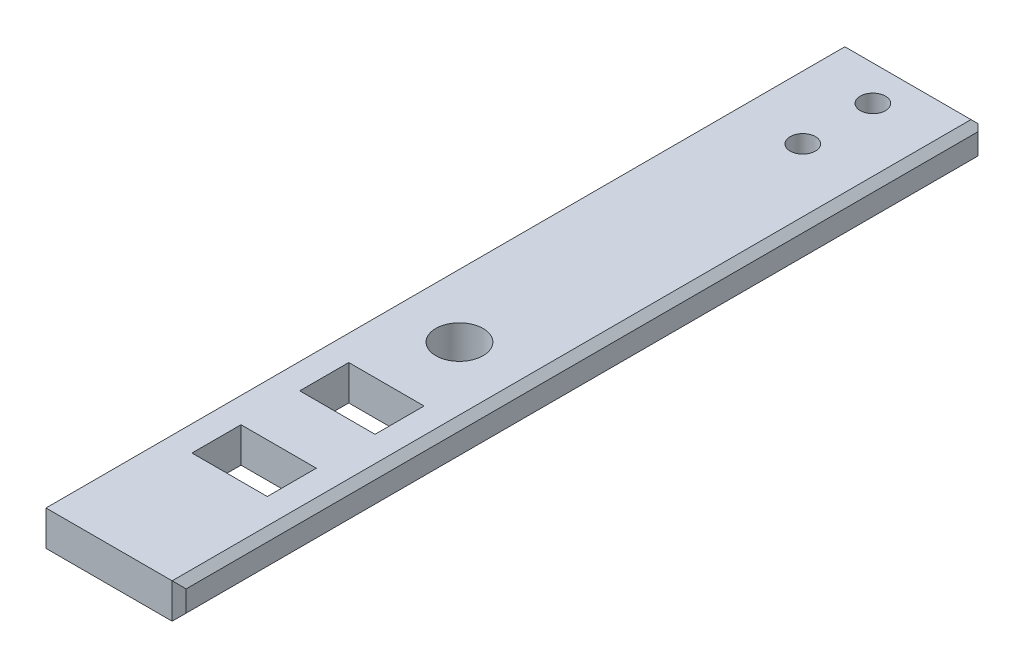
ISO-10303-21;
HEADER;
FILE_DESCRIPTION(('STEP AP214'),'2;1');
FILE_NAME('part.step','',(''),(''),'','','');
FILE_SCHEMA(('AUTOMOTIVE_DESIGN { 1 0 10303 214 1 1 1 1 }'));
ENDSEC;
DATA;
#1=APPLICATION_CONTEXT('core data for automotive mechanical design processes');
#2=APPLICATION_PROTOCOL_DEFINITION('international standard','automotive_design',2000,#1);
#3=PRODUCT_CONTEXT('',#1,'mechanical');
#4=PRODUCT('Part','Part','',(#3));
#5=PRODUCT_RELATED_PRODUCT_CATEGORY('part','',(#4));
#6=PRODUCT_DEFINITION_FORMATION('','',#4);
#7=PRODUCT_DEFINITION_CONTEXT('part definition',#1,'design');
#8=PRODUCT_DEFINITION('design','',#6,#7);
#9=PRODUCT_DEFINITION_SHAPE('','',#8);
#10=(LENGTH_UNIT() NAMED_UNIT(*) SI_UNIT(.MILLI.,.METRE.));
#11=(NAMED_UNIT(*) PLANE_ANGLE_UNIT() SI_UNIT($,.RADIAN.));
#12=(NAMED_UNIT(*) SI_UNIT($,.STERADIAN.) SOLID_ANGLE_UNIT());
#13=UNCERTAINTY_MEASURE_WITH_UNIT(LENGTH_MEASURE(1.E-05),#10,'distance_accuracy_value','');
#14=(GEOMETRIC_REPRESENTATION_CONTEXT(3) GLOBAL_UNCERTAINTY_ASSIGNED_CONTEXT((#13)) GLOBAL_UNIT_ASSIGNED_CONTEXT((#10,
#11,#12)) REPRESENTATION_CONTEXT('',''));
#15=CARTESIAN_POINT('',(0.,0.,0.));
#16=DIRECTION('',(0.,0.,1.));
#17=DIRECTION('',(1.,0.,0.));
#18=AXIS2_PLACEMENT_3D('',#15,#16,#17);
#19=CARTESIAN_POINT('',(0.,5.,0.));
#20=DIRECTION('',(0.,-1.,0.));
#21=DIRECTION('',(0.,0.,-1.));
#22=AXIS2_PLACEMENT_3D('',#19,#20,#21);
#23=PLANE('',#22);
#24=CARTESIAN_POINT('',(10.,5.,-50.));
#25=DIRECTION('',(0.,1.,0.));
#26=DIRECTION('',(0.,0.,1.));
#27=AXIS2_PLACEMENT_3D('',#24,#25,#26);
#28=CIRCLE('',#27,3.375);
#29=CARTESIAN_POINT('',(10.,5.,-46.625));
#30=VERTEX_POINT('',#29);
#31=EDGE_CURVE('E792',#30,#30,#28,.T.);
#32=ORIENTED_EDGE('',*,*,#31,.F.);
#33=EDGE_LOOP('',(#32));
#34=FACE_BOUND('',#33,.T.);
#35=DIRECTION('',(1.,0.,0.));
#36=VECTOR('',#35,1.);
#37=CARTESIAN_POINT('',(15.3749999999999,5.,-39.5793225891778));
#38=LINE('',#37,#36);
#39=CARTESIAN_POINT('',(4.62499999999994,5.,-39.5793225891778));
#40=VERTEX_POINT('',#39);
#41=CARTESIAN_POINT('',(15.3749999999999,5.,-39.5793225891778));
#42=VERTEX_POINT('',#41);
#43=EDGE_CURVE('E197',#40,#42,#38,.T.);
#44=ORIENTED_EDGE('',*,*,#43,.T.);
#45=DIRECTION('',(0.,0.,1.));
#46=VECTOR('',#45,1.);
#47=CARTESIAN_POINT('',(15.3749999999999,5.,-39.5793225891778));
#48=LINE('',#47,#46);
#49=CARTESIAN_POINT('',(15.3749999999999,5.,-32.5793225891778));
#50=VERTEX_POINT('',#49);
#51=EDGE_CURVE('E205',#42,#50,#48,.T.);
#52=ORIENTED_EDGE('',*,*,#51,.T.);
#53=DIRECTION('',(-1.,0.,0.));
#54=VECTOR('',#53,1.);
#55=CARTESIAN_POINT('',(15.3749999999999,5.,-32.5793225891778));
#56=LINE('',#55,#54);
#57=CARTESIAN_POINT('',(4.62499999999994,5.,-32.5793225891778));
#58=VERTEX_POINT('',#57);
#59=EDGE_CURVE('E219',#50,#58,#56,.T.);
#60=ORIENTED_EDGE('',*,*,#59,.T.);
#61=DIRECTION('',(0.,0.,-1.));
#62=VECTOR('',#61,1.);
#63=CARTESIAN_POINT('',(4.62499999999994,5.,-39.5793225891778));
#64=LINE('',#63,#62);
#65=EDGE_CURVE('E67',#58,#40,#64,.T.);
#66=ORIENTED_EDGE('',*,*,#65,.T.);
#67=EDGE_LOOP('',(#44,#52,#60,#66));
#68=FACE_BOUND('',#67,.T.);
#69=DIRECTION('',(0.,0.,-1.));
#70=VECTOR('',#69,1.);
#71=CARTESIAN_POINT('',(19.,5.,0.));
#72=LINE('',#71,#70);
#73=CARTESIAN_POINT('',(19.,5.,0.));
#74=VERTEX_POINT('',#73);
#75=CARTESIAN_POINT('',(19.,5.,-114.));
#76=VERTEX_POINT('',#75);
#77=EDGE_CURVE('E334',#74,#76,#72,.T.);
#78=ORIENTED_EDGE('',*,*,#77,.T.);
#79=DIRECTION('',(-1.,0.,0.));
#80=VECTOR('',#79,1.);
#81=CARTESIAN_POINT('',(0.,5.,-114.));
#82=LINE('',#81,#80);
#83=CARTESIAN_POINT('',(1.,5.,-114.));
#84=VERTEX_POINT('',#83);
#85=EDGE_CURVE('E366',#76,#84,#82,.T.);
#86=ORIENTED_EDGE('',*,*,#85,.T.);
#87=DIRECTION('',(0.,0.,1.));
#88=VECTOR('',#87,1.);
#89=CARTESIAN_POINT('',(1.,5.,0.));
#90=LINE('',#89,#88);
#91=CARTESIAN_POINT('',(1.,5.,0.));
#92=VERTEX_POINT('',#91);
#93=EDGE_CURVE('E331',#84,#92,#90,.T.);
#94=ORIENTED_EDGE('',*,*,#93,.T.);
#95=DIRECTION('',(1.,0.,0.));
#96=VECTOR('',#95,1.);
#97=CARTESIAN_POINT('',(0.,5.,0.));
#98=LINE('',#97,#96);
#99=EDGE_CURVE('E301',#92,#74,#98,.T.);
#100=ORIENTED_EDGE('',*,*,#99,.T.);
#101=EDGE_LOOP('',(#78,#86,#94,#100));
#102=FACE_BOUND('',#101,.T.);
#103=CARTESIAN_POINT('',(10.,5.,-99.));
#104=DIRECTION('',(0.,-1.,0.));
#105=DIRECTION('',(0.,0.,-1.));
#106=AXIS2_PLACEMENT_3D('',#103,#104,#105);
#107=CIRCLE('',#106,1.8);
#108=CARTESIAN_POINT('',(10.,5.,-100.8));
#109=VERTEX_POINT('',#108);
#110=EDGE_CURVE('E296',#109,#109,#107,.T.);
#111=ORIENTED_EDGE('',*,*,#110,.T.);
#112=EDGE_LOOP('',(#111));
#113=FACE_BOUND('',#112,.T.);
#114=CARTESIAN_POINT('',(10.,5.,-109.));
#115=DIRECTION('',(0.,-1.,0.));
#116=DIRECTION('',(0.,0.,-1.));
#117=AXIS2_PLACEMENT_3D('',#114,#115,#116);
#118=CIRCLE('',#117,1.8);
#119=CARTESIAN_POINT('',(10.,5.,-110.8));
#120=VERTEX_POINT('',#119);
#121=EDGE_CURVE('E288',#120,#120,#118,.T.);
#122=ORIENTED_EDGE('',*,*,#121,.T.);
#123=EDGE_LOOP('',(#122));
#124=FACE_BOUND('',#123,.T.);
#125=DIRECTION('',(0.,0.,-1.));
#126=VECTOR('',#125,1.);
#127=CARTESIAN_POINT('',(15.3749999999999,5.,-17.2043225891778));
#128=LINE('',#127,#126);
#129=CARTESIAN_POINT('',(15.3749999999999,5.,-17.2043225891778));
#130=VERTEX_POINT('',#129);
#131=CARTESIAN_POINT('',(15.3749999999999,5.,-24.2043225891778));
#132=VERTEX_POINT('',#131);
#133=EDGE_CURVE('E243',#130,#132,#128,.T.);
#134=ORIENTED_EDGE('',*,*,#133,.F.);
#135=DIRECTION('',(1.,0.,0.));
#136=VECTOR('',#135,1.);
#137=CARTESIAN_POINT('',(15.3749999999999,5.,-17.2043225891778));
#138=LINE('',#137,#136);
#139=CARTESIAN_POINT('',(4.62499999999994,5.,-17.2043225891778));
#140=VERTEX_POINT('',#139);
#141=EDGE_CURVE('E254',#140,#130,#138,.T.);
#142=ORIENTED_EDGE('',*,*,#141,.F.);
#143=DIRECTION('',(0.,0.,1.));
#144=VECTOR('',#143,1.);
#145=CARTESIAN_POINT('',(4.62499999999994,5.,-17.2043225891778));
#146=LINE('',#145,#144);
#147=CARTESIAN_POINT('',(4.62499999999994,5.,-24.2043225891778));
#148=VERTEX_POINT('',#147);
#149=EDGE_CURVE('E250',#148,#140,#146,.T.);
#150=ORIENTED_EDGE('',*,*,#149,.F.);
#151=DIRECTION('',(-1.,0.,0.));
#152=VECTOR('',#151,1.);
#153=CARTESIAN_POINT('',(15.3749999999999,5.,-24.2043225891778));
#154=LINE('',#153,#152);
#155=EDGE_CURVE('E246',#132,#148,#154,.T.);
#156=ORIENTED_EDGE('',*,*,#155,.F.);
#157=EDGE_LOOP('',(#134,#142,#150,#156));
#158=FACE_BOUND('',#157,.T.);
#159=ADVANCED_FACE('F49',(#34,#68,#102,#113,#124,#158),#23,.F.);
#160=CARTESIAN_POINT('',(0.,0.,0.));
#161=DIRECTION('',(0.,-1.,0.));
#162=DIRECTION('',(0.,0.,-1.));
#163=AXIS2_PLACEMENT_3D('',#160,#161,#162);
#164=PLANE('',#163);
#165=CARTESIAN_POINT('',(10.,0.,-50.));
#166=DIRECTION('',(0.,-1.,0.));
#167=DIRECTION('',(0.,0.,-1.));
#168=AXIS2_PLACEMENT_3D('',#165,#166,#167);
#169=CIRCLE('',#168,3.375);
#170=CARTESIAN_POINT('',(10.,0.,-53.375));
#171=VERTEX_POINT('',#170);
#172=EDGE_CURVE('E54',#171,#171,#169,.T.);
#173=ORIENTED_EDGE('',*,*,#172,.F.);
#174=EDGE_LOOP('',(#173));
#175=FACE_BOUND('',#174,.T.);
#176=DIRECTION('',(0.,0.,1.));
#177=VECTOR('',#176,1.);
#178=CARTESIAN_POINT('',(15.3749999999999,0.,-39.5793225891778));
#179=LINE('',#178,#177);
#180=CARTESIAN_POINT('',(15.3749999999999,0.,-39.5793225891778));
#181=VERTEX_POINT('',#180);
#182=CARTESIAN_POINT('',(15.3749999999999,0.,-32.5793225891778));
#183=VERTEX_POINT('',#182);
#184=EDGE_CURVE('E75',#181,#183,#179,.T.);
#185=ORIENTED_EDGE('',*,*,#184,.F.);
#186=DIRECTION('',(1.,0.,0.));
#187=VECTOR('',#186,1.);
#188=CARTESIAN_POINT('',(15.3749999999999,0.,-39.5793225891778));
#189=LINE('',#188,#187);
#190=CARTESIAN_POINT('',(4.62499999999994,0.,-39.5793225891778));
#191=VERTEX_POINT('',#190);
#192=EDGE_CURVE('E199',#191,#181,#189,.T.);
#193=ORIENTED_EDGE('',*,*,#192,.F.);
#194=DIRECTION('',(0.,0.,-1.));
#195=VECTOR('',#194,1.);
#196=CARTESIAN_POINT('',(4.62499999999994,0.,-39.5793225891778));
#197=LINE('',#196,#195);
#198=CARTESIAN_POINT('',(4.62499999999994,0.,-32.5793225891778));
#199=VERTEX_POINT('',#198);
#200=EDGE_CURVE('E229',#199,#191,#197,.T.);
#201=ORIENTED_EDGE('',*,*,#200,.F.);
#202=DIRECTION('',(-1.,0.,0.));
#203=VECTOR('',#202,1.);
#204=CARTESIAN_POINT('',(15.3749999999999,0.,-32.5793225891778));
#205=LINE('',#204,#203);
#206=EDGE_CURVE('E212',#183,#199,#205,.T.);
#207=ORIENTED_EDGE('',*,*,#206,.F.);
#208=EDGE_LOOP('',(#185,#193,#201,#207));
#209=FACE_BOUND('',#208,.T.);
#210=CARTESIAN_POINT('',(10.,0.,-109.));
#211=DIRECTION('',(0.,-1.,0.));
#212=DIRECTION('',(0.,0.,-1.));
#213=AXIS2_PLACEMENT_3D('',#210,#211,#212);
#214=CIRCLE('',#213,1.8);
#215=CARTESIAN_POINT('',(10.,0.,-110.8));
#216=VERTEX_POINT('',#215);
#217=EDGE_CURVE('E284',#216,#216,#214,.T.);
#218=ORIENTED_EDGE('',*,*,#217,.F.);
#219=EDGE_LOOP('',(#218));
#220=FACE_BOUND('',#219,.T.);
#221=CARTESIAN_POINT('',(10.,0.,-99.));
#222=DIRECTION('',(0.,-1.,0.));
#223=DIRECTION('',(0.,0.,-1.));
#224=AXIS2_PLACEMENT_3D('',#221,#222,#223);
#225=CIRCLE('',#224,1.8);
#226=CARTESIAN_POINT('',(10.,0.,-100.8));
#227=VERTEX_POINT('',#226);
#228=EDGE_CURVE('E292',#227,#227,#225,.T.);
#229=ORIENTED_EDGE('',*,*,#228,.F.);
#230=EDGE_LOOP('',(#229));
#231=FACE_BOUND('',#230,.T.);
#232=DIRECTION('',(0.,0.,-1.));
#233=VECTOR('',#232,1.);
#234=CARTESIAN_POINT('',(1.,0.,-115.));
#235=LINE('',#234,#233);
#236=CARTESIAN_POINT('',(1.,0.,0.));
#237=VERTEX_POINT('',#236);
#238=CARTESIAN_POINT('',(1.,0.,-114.));
#239=VERTEX_POINT('',#238);
#240=EDGE_CURVE('E346',#237,#239,#235,.T.);
#241=ORIENTED_EDGE('',*,*,#240,.T.);
#242=DIRECTION('',(1.,0.,0.));
#243=VECTOR('',#242,1.);
#244=CARTESIAN_POINT('',(19.,0.,-114.));
#245=LINE('',#244,#243);
#246=CARTESIAN_POINT('',(19.,0.,-114.));
#247=VERTEX_POINT('',#246);
#248=EDGE_CURVE('E60',#239,#247,#245,.T.);
#249=ORIENTED_EDGE('',*,*,#248,.T.);
#250=DIRECTION('',(0.,0.,1.));
#251=VECTOR('',#250,1.);
#252=CARTESIAN_POINT('',(19.,0.,0.));
#253=LINE('',#252,#251);
#254=CARTESIAN_POINT('',(19.,0.,0.));
#255=VERTEX_POINT('',#254);
#256=EDGE_CURVE('E350',#247,#255,#253,.T.);
#257=ORIENTED_EDGE('',*,*,#256,.T.);
#258=DIRECTION('',(1.,0.,0.));
#259=VECTOR('',#258,1.);
#260=CARTESIAN_POINT('',(0.,0.,0.));
#261=LINE('',#260,#259);
#262=EDGE_CURVE('E306',#237,#255,#261,.T.);
#263=ORIENTED_EDGE('',*,*,#262,.F.);
#264=EDGE_LOOP('',(#241,#249,#257,#263));
#265=FACE_BOUND('',#264,.T.);
#266=DIRECTION('',(1.,0.,0.));
#267=VECTOR('',#266,1.);
#268=CARTESIAN_POINT('',(15.3749999999999,0.,-17.2043225891778));
#269=LINE('',#268,#267);
#270=CARTESIAN_POINT('',(4.62499999999994,0.,-17.2043225891778));
#271=VERTEX_POINT('',#270);
#272=CARTESIAN_POINT('',(15.3749999999999,0.,-17.2043225891778));
#273=VERTEX_POINT('',#272);
#274=EDGE_CURVE('E247',#271,#273,#269,.T.);
#275=ORIENTED_EDGE('',*,*,#274,.T.);
#276=DIRECTION('',(0.,0.,-1.));
#277=VECTOR('',#276,1.);
#278=CARTESIAN_POINT('',(15.3749999999999,0.,-17.2043225891778));
#279=LINE('',#278,#277);
#280=CARTESIAN_POINT('',(15.3749999999999,0.,-24.2043225891778));
#281=VERTEX_POINT('',#280);
#282=EDGE_CURVE('E201',#273,#281,#279,.T.);
#283=ORIENTED_EDGE('',*,*,#282,.T.);
#284=DIRECTION('',(-1.,0.,0.));
#285=VECTOR('',#284,1.);
#286=CARTESIAN_POINT('',(15.3749999999999,0.,-24.2043225891778));
#287=LINE('',#286,#285);
#288=CARTESIAN_POINT('',(4.62499999999994,0.,-24.2043225891778));
#289=VERTEX_POINT('',#288);
#290=EDGE_CURVE('E261',#281,#289,#287,.T.);
#291=ORIENTED_EDGE('',*,*,#290,.T.);
#292=DIRECTION('',(0.,0.,1.));
#293=VECTOR('',#292,1.);
#294=CARTESIAN_POINT('',(4.62499999999994,0.,-17.2043225891778));
#295=LINE('',#294,#293);
#296=EDGE_CURVE('E265',#289,#271,#295,.T.);
#297=ORIENTED_EDGE('',*,*,#296,.T.);
#298=EDGE_LOOP('',(#275,#283,#291,#297));
#299=FACE_BOUND('',#298,.T.);
#300=ADVANCED_FACE('F428',(#175,#209,#220,#231,#265,#299),#164,.T.);
#301=CARTESIAN_POINT('',(0.,5.,0.));
#302=DIRECTION('',(1.,0.,0.));
#303=DIRECTION('',(0.,0.,-1.));
#304=AXIS2_PLACEMENT_3D('',#301,#302,#303);
#305=PLANE('',#304);
#306=DIRECTION('',(0.,0.,-1.));
#307=VECTOR('',#306,1.);
#308=CARTESIAN_POINT('',(0.,4.,0.));
#309=LINE('',#308,#307);
#310=CARTESIAN_POINT('',(0.,4.,-1.));
#311=VERTEX_POINT('',#310);
#312=CARTESIAN_POINT('',(0.,4.,-114.));
#313=VERTEX_POINT('',#312);
#314=EDGE_CURVE('E359',#311,#313,#309,.T.);
#315=ORIENTED_EDGE('',*,*,#314,.T.);
#316=DIRECTION('',(0.,-1.,0.));
#317=VECTOR('',#316,1.);
#318=CARTESIAN_POINT('',(0.,5.,-114.));
#319=LINE('',#318,#317);
#320=CARTESIAN_POINT('',(0.,1.,-114.));
#321=VERTEX_POINT('',#320);
#322=EDGE_CURVE('E362',#313,#321,#319,.T.);
#323=ORIENTED_EDGE('',*,*,#322,.T.);
#324=DIRECTION('',(0.,0.,1.));
#325=VECTOR('',#324,1.);
#326=CARTESIAN_POINT('',(0.,1.,0.));
#327=LINE('',#326,#325);
#328=CARTESIAN_POINT('',(0.,1.,-1.));
#329=VERTEX_POINT('',#328);
#330=EDGE_CURVE('E353',#321,#329,#327,.T.);
#331=ORIENTED_EDGE('',*,*,#330,.T.);
#332=DIRECTION('',(0.,1.,0.));
#333=VECTOR('',#332,1.);
#334=CARTESIAN_POINT('',(0.,5.,-1.));
#335=LINE('',#334,#333);
#336=EDGE_CURVE('E356',#329,#311,#335,.T.);
#337=ORIENTED_EDGE('',*,*,#336,.T.);
#338=EDGE_LOOP('',(#315,#323,#331,#337));
#339=FACE_BOUND('',#338,.T.);
#340=ADVANCED_FACE('F491',(#339),#305,.F.);
#341=CARTESIAN_POINT('',(0.,5.,0.));
#342=DIRECTION('',(0.,0.,-1.));
#343=DIRECTION('',(-1.,0.,0.));
#344=AXIS2_PLACEMENT_3D('',#341,#342,#343);
#345=PLANE('',#344);
#346=ORIENTED_EDGE('',*,*,#262,.T.);
#347=DIRECTION('',(0.,1.,0.));
#348=VECTOR('',#347,1.);
#349=CARTESIAN_POINT('',(19.,5.,0.));
#350=LINE('',#349,#348);
#351=EDGE_CURVE('E327',#255,#74,#350,.T.);
#352=ORIENTED_EDGE('',*,*,#351,.T.);
#353=ORIENTED_EDGE('',*,*,#99,.F.);
#354=DIRECTION('',(0.,-1.,0.));
#355=VECTOR('',#354,1.);
#356=CARTESIAN_POINT('',(1.,5.,0.));
#357=LINE('',#356,#355);
#358=EDGE_CURVE('E324',#92,#237,#357,.T.);
#359=ORIENTED_EDGE('',*,*,#358,.T.);
#360=EDGE_LOOP('',(#346,#352,#353,#359));
#361=FACE_BOUND('',#360,.T.);
#362=ADVANCED_FACE('F470',(#361),#345,.F.);
#363=CARTESIAN_POINT('',(20.,5.,0.));
#364=DIRECTION('',(-1.,0.,0.));
#365=DIRECTION('',(0.,0.,1.));
#366=AXIS2_PLACEMENT_3D('',#363,#364,#365);
#367=PLANE('',#366);
#368=DIRECTION('',(0.,0.,1.));
#369=VECTOR('',#368,1.);
#370=CARTESIAN_POINT('',(20.,4.,0.));
#371=LINE('',#370,#369);
#372=CARTESIAN_POINT('',(20.,4.,-114.));
#373=VERTEX_POINT('',#372);
#374=CARTESIAN_POINT('',(20.,4.,-1.));
#375=VERTEX_POINT('',#374);
#376=EDGE_CURVE('E317',#373,#375,#371,.T.);
#377=ORIENTED_EDGE('',*,*,#376,.T.);
#378=DIRECTION('',(0.,-1.,0.));
#379=VECTOR('',#378,1.);
#380=CARTESIAN_POINT('',(20.,5.,-1.));
#381=LINE('',#380,#379);
#382=CARTESIAN_POINT('',(20.,1.,-1.));
#383=VERTEX_POINT('',#382);
#384=EDGE_CURVE('E320',#375,#383,#381,.T.);
#385=ORIENTED_EDGE('',*,*,#384,.T.);
#386=DIRECTION('',(0.,0.,-1.));
#387=VECTOR('',#386,1.);
#388=CARTESIAN_POINT('',(20.,1.,-115.));
#389=LINE('',#388,#387);
#390=CARTESIAN_POINT('',(20.,1.,-114.));
#391=VERTEX_POINT('',#390);
#392=EDGE_CURVE('E305',#383,#391,#389,.T.);
#393=ORIENTED_EDGE('',*,*,#392,.T.);
#394=DIRECTION('',(0.,1.,0.));
#395=VECTOR('',#394,1.);
#396=CARTESIAN_POINT('',(20.,5.,-114.));
#397=LINE('',#396,#395);
#398=EDGE_CURVE('E314',#391,#373,#397,.T.);
#399=ORIENTED_EDGE('',*,*,#398,.T.);
#400=EDGE_LOOP('',(#377,#385,#393,#399));
#401=FACE_BOUND('',#400,.T.);
#402=ADVANCED_FACE('F464',(#401),#367,.F.);
#403=CARTESIAN_POINT('',(0.,5.,-115.));
#404=DIRECTION('',(0.,0.,1.));
#405=DIRECTION('',(1.,0.,0.));
#406=AXIS2_PLACEMENT_3D('',#403,#404,#405);
#407=PLANE('',#406);
#408=DIRECTION('',(0.,1.,0.));
#409=VECTOR('',#408,1.);
#410=CARTESIAN_POINT('',(1.,5.,-115.));
#411=LINE('',#410,#409);
#412=CARTESIAN_POINT('',(1.,1.,-115.));
#413=VERTEX_POINT('',#412);
#414=CARTESIAN_POINT('',(1.,4.,-115.));
#415=VERTEX_POINT('',#414);
#416=EDGE_CURVE('E338',#413,#415,#411,.T.);
#417=ORIENTED_EDGE('',*,*,#416,.T.);
#418=DIRECTION('',(1.,0.,0.));
#419=VECTOR('',#418,1.);
#420=CARTESIAN_POINT('',(0.,4.,-115.));
#421=LINE('',#420,#419);
#422=CARTESIAN_POINT('',(19.,4.,-115.));
#423=VERTEX_POINT('',#422);
#424=EDGE_CURVE('E409',#415,#423,#421,.T.);
#425=ORIENTED_EDGE('',*,*,#424,.T.);
#426=DIRECTION('',(0.,-1.,0.));
#427=VECTOR('',#426,1.);
#428=CARTESIAN_POINT('',(19.,5.,-115.));
#429=LINE('',#428,#427);
#430=CARTESIAN_POINT('',(19.,1.,-115.));
#431=VERTEX_POINT('',#430);
#432=EDGE_CURVE('E342',#423,#431,#429,.T.);
#433=ORIENTED_EDGE('',*,*,#432,.T.);
#434=DIRECTION('',(-1.,0.,0.));
#435=VECTOR('',#434,1.);
#436=CARTESIAN_POINT('',(1.,1.,-115.));
#437=LINE('',#436,#435);
#438=EDGE_CURVE('E405',#431,#413,#437,.T.);
#439=ORIENTED_EDGE('',*,*,#438,.T.);
#440=EDGE_LOOP('',(#417,#425,#433,#439));
#441=FACE_BOUND('',#440,.T.);
#442=ADVANCED_FACE('F448',(#441),#407,.F.);
#443=CARTESIAN_POINT('',(19.,5.,-115.));
#444=DIRECTION('',(-0.707106781186547,0.,0.707106781186547));
#445=DIRECTION('',(0.,-1.,0.));
#446=AXIS2_PLACEMENT_3D('',#443,#444,#445);
#447=PLANE('',#446);
#448=ORIENTED_EDGE('',*,*,#432,.F.);
#449=DIRECTION('',(0.577350269189623,0.577350269189631,0.577350269189623));
#450=VECTOR('',#449,1.);
#451=CARTESIAN_POINT('',(19.3333333333333,4.33333333333334,-114.666666666667));
#452=LINE('',#451,#450);
#453=CARTESIAN_POINT('',(19.5,4.5,-114.5));
#454=VERTEX_POINT('',#453);
#455=EDGE_CURVE('E415',#423,#454,#452,.T.);
#456=ORIENTED_EDGE('',*,*,#455,.T.);
#457=DIRECTION('',(0.577350269189626,-0.577350269189626,0.577350269189626));
#458=VECTOR('',#457,1.);
#459=CARTESIAN_POINT('',(19.,5.,-115.));
#460=LINE('',#459,#458);
#461=EDGE_CURVE('E310',#373,#454,#460,.F.);
#462=ORIENTED_EDGE('',*,*,#461,.F.);
#463=ORIENTED_EDGE('',*,*,#398,.F.);
#464=DIRECTION('',(-0.577350269189626,-0.577350269189626,-0.577350269189626));
#465=VECTOR('',#464,1.);
#466=CARTESIAN_POINT('',(58.,39.,-76.));
#467=LINE('',#466,#465);
#468=CARTESIAN_POINT('',(19.5,0.500000000000007,-114.5));
#469=VERTEX_POINT('',#468);
#470=EDGE_CURVE('E374',#469,#391,#467,.F.);
#471=ORIENTED_EDGE('',*,*,#470,.F.);
#472=DIRECTION('',(0.577350269189626,-0.577350269189626,0.577350269189626));
#473=VECTOR('',#472,1.);
#474=CARTESIAN_POINT('',(17.6666666666667,2.33333333333333,-116.333333333333));
#475=LINE('',#474,#473);
#476=EDGE_CURVE('E412',#469,#431,#475,.F.);
#477=ORIENTED_EDGE('',*,*,#476,.T.);
#478=EDGE_LOOP('',(#448,#456,#462,#463,#471,#477));
#479=FACE_BOUND('',#478,.T.);
#480=ADVANCED_FACE('F444',(#479),#447,.F.);
#481=CARTESIAN_POINT('',(19.,5.,0.));
#482=DIRECTION('',(-0.707106781186547,-0.707106781186547,0.));
#483=DIRECTION('',(0.,0.,-1.));
#484=AXIS2_PLACEMENT_3D('',#481,#482,#483);
#485=PLANE('',#484);
#486=ORIENTED_EDGE('',*,*,#461,.T.);
#487=DIRECTION('',(-0.577350269189628,0.577350269189628,0.57735026918962));
#488=VECTOR('',#487,1.);
#489=CARTESIAN_POINT('',(-18.9999999999998,42.9999999999998,-76.0000000000007));
#490=LINE('',#489,#488);
#491=EDGE_CURVE('E418',#454,#76,#490,.T.);
#492=ORIENTED_EDGE('',*,*,#491,.T.);
#493=ORIENTED_EDGE('',*,*,#77,.F.);
#494=DIRECTION('',(0.577350269189626,-0.577350269189626,-0.577350269189626));
#495=VECTOR('',#494,1.);
#496=CARTESIAN_POINT('',(19.,5.,0.));
#497=LINE('',#496,#495);
#498=EDGE_CURVE('E370',#375,#74,#497,.F.);
#499=ORIENTED_EDGE('',*,*,#498,.F.);
#500=ORIENTED_EDGE('',*,*,#376,.F.);
#501=EDGE_LOOP('',(#486,#492,#493,#499,#500));
#502=FACE_BOUND('',#501,.T.);
#503=ADVANCED_FACE('F459',(#502),#485,.F.);
#504=CARTESIAN_POINT('',(20.,1.,0.));
#505=DIRECTION('',(0.707106781186547,-0.707106781186547,0.));
#506=DIRECTION('',(0.,0.,1.));
#507=AXIS2_PLACEMENT_3D('',#504,#505,#506);
#508=PLANE('',#507);
#509=ORIENTED_EDGE('',*,*,#256,.F.);
#510=DIRECTION('',(0.577350269189626,0.577350269189626,-0.577350269189626));
#511=VECTOR('',#510,1.);
#512=CARTESIAN_POINT('',(-18.3333333333333,-37.3333333333333,-76.6666666666667));
#513=LINE('',#512,#511);
#514=EDGE_CURVE('E11',#247,#469,#513,.T.);
#515=ORIENTED_EDGE('',*,*,#514,.T.);
#516=ORIENTED_EDGE('',*,*,#470,.T.);
#517=ORIENTED_EDGE('',*,*,#392,.F.);
#518=DIRECTION('',(0.577350269189626,0.577350269189626,-0.577350269189626));
#519=VECTOR('',#518,1.);
#520=CARTESIAN_POINT('',(19.6666666666667,0.666666666666667,-0.666666666666667));
#521=LINE('',#520,#519);
#522=EDGE_CURVE('E367',#255,#383,#521,.T.);
#523=ORIENTED_EDGE('',*,*,#522,.F.);
#524=EDGE_LOOP('',(#509,#515,#516,#517,#523));
#525=FACE_BOUND('',#524,.T.);
#526=ADVANCED_FACE('F437',(#525),#508,.T.);
#527=CARTESIAN_POINT('',(20.,5.,-1.));
#528=DIRECTION('',(-0.707106781186547,0.,-0.707106781186547));
#529=DIRECTION('',(0.,-1.,0.));
#530=AXIS2_PLACEMENT_3D('',#527,#528,#529);
#531=PLANE('',#530);
#532=ORIENTED_EDGE('',*,*,#498,.T.);
#533=ORIENTED_EDGE('',*,*,#351,.F.);
#534=ORIENTED_EDGE('',*,*,#522,.T.);
#535=ORIENTED_EDGE('',*,*,#384,.F.);
#536=EDGE_LOOP('',(#532,#533,#534,#535));
#537=FACE_BOUND('',#536,.T.);
#538=ADVANCED_FACE('F466',(#537),#531,.F.);
#539=CARTESIAN_POINT('',(1.,5.,0.));
#540=DIRECTION('',(0.707106781186547,0.,-0.707106781186547));
#541=DIRECTION('',(0.,-1.,0.));
#542=AXIS2_PLACEMENT_3D('',#539,#540,#541);
#543=PLANE('',#542);
#544=DIRECTION('',(0.577350269189626,-0.577350269189626,0.577350269189626));
#545=VECTOR('',#544,1.);
#546=CARTESIAN_POINT('',(0.333333333333334,0.666666666666667,-0.666666666666667));
#547=LINE('',#546,#545);
#548=EDGE_CURVE('E386',#237,#329,#547,.F.);
#549=ORIENTED_EDGE('',*,*,#548,.F.);
#550=ORIENTED_EDGE('',*,*,#358,.F.);
#551=DIRECTION('',(-0.577350269189626,-0.577350269189626,-0.577350269189626));
#552=VECTOR('',#551,1.);
#553=CARTESIAN_POINT('',(1.,5.,0.));
#554=LINE('',#553,#552);
#555=EDGE_CURVE('E371',#311,#92,#554,.F.);
#556=ORIENTED_EDGE('',*,*,#555,.F.);
#557=ORIENTED_EDGE('',*,*,#336,.F.);
#558=EDGE_LOOP('',(#549,#550,#556,#557));
#559=FACE_BOUND('',#558,.T.);
#560=ADVANCED_FACE('F482',(#559),#543,.F.);
#561=CARTESIAN_POINT('',(1.,5.,0.));
#562=DIRECTION('',(0.707106781186547,-0.707106781186547,0.));
#563=DIRECTION('',(0.,0.,1.));
#564=AXIS2_PLACEMENT_3D('',#561,#562,#563);
#565=PLANE('',#564);
#566=ORIENTED_EDGE('',*,*,#93,.F.);
#567=DIRECTION('',(-0.577350269189628,-0.577350269189628,-0.57735026918962));
#568=VECTOR('',#567,1.);
#569=CARTESIAN_POINT('',(38.9999999999998,42.9999999999998,-76.0000000000007));
#570=LINE('',#569,#568);
#571=CARTESIAN_POINT('',(0.499999999999994,4.49999999999999,-114.5));
#572=VERTEX_POINT('',#571);
#573=EDGE_CURVE('E396',#84,#572,#570,.T.);
#574=ORIENTED_EDGE('',*,*,#573,.T.);
#575=DIRECTION('',(-0.577350269189626,-0.577350269189626,0.577350269189626));
#576=VECTOR('',#575,1.);
#577=CARTESIAN_POINT('',(-37.3333333333333,-33.3333333333333,-76.6666666666667));
#578=LINE('',#577,#576);
#579=EDGE_CURVE('E382',#313,#572,#578,.F.);
#580=ORIENTED_EDGE('',*,*,#579,.F.);
#581=ORIENTED_EDGE('',*,*,#314,.F.);
#582=ORIENTED_EDGE('',*,*,#555,.T.);
#583=EDGE_LOOP('',(#566,#574,#580,#581,#582));
#584=FACE_BOUND('',#583,.T.);
#585=ADVANCED_FACE('F475',(#584),#565,.F.);
#586=CARTESIAN_POINT('',(0.,1.,0.));
#587=DIRECTION('',(-0.707106781186547,-0.707106781186547,0.));
#588=DIRECTION('',(0.,0.,-1.));
#589=AXIS2_PLACEMENT_3D('',#586,#587,#588);
#590=PLANE('',#589);
#591=DIRECTION('',(-0.577350269189626,0.577350269189626,0.577350269189626));
#592=VECTOR('',#591,1.);
#593=CARTESIAN_POINT('',(-38.,39.,-76.));
#594=LINE('',#593,#592);
#595=CARTESIAN_POINT('',(0.499999999999994,0.500000000000007,-114.5));
#596=VERTEX_POINT('',#595);
#597=EDGE_CURVE('E300',#596,#321,#594,.T.);
#598=ORIENTED_EDGE('',*,*,#597,.F.);
#599=DIRECTION('',(0.577350269189626,-0.577350269189626,0.577350269189626));
#600=VECTOR('',#599,1.);
#601=CARTESIAN_POINT('',(38.3333333333333,-37.3333333333333,-76.6666666666667));
#602=LINE('',#601,#600);
#603=EDGE_CURVE('E421',#596,#239,#602,.T.);
#604=ORIENTED_EDGE('',*,*,#603,.T.);
#605=ORIENTED_EDGE('',*,*,#240,.F.);
#606=ORIENTED_EDGE('',*,*,#548,.T.);
#607=ORIENTED_EDGE('',*,*,#330,.F.);
#608=EDGE_LOOP('',(#598,#604,#605,#606,#607));
#609=FACE_BOUND('',#608,.T.);
#610=ADVANCED_FACE('F486',(#609),#590,.T.);
#611=CARTESIAN_POINT('',(0.,5.,-114.));
#612=DIRECTION('',(0.707106781186547,0.,0.707106781186547));
#613=DIRECTION('',(0.,-1.,0.));
#614=AXIS2_PLACEMENT_3D('',#611,#612,#613);
#615=PLANE('',#614);
#616=ORIENTED_EDGE('',*,*,#579,.T.);
#617=DIRECTION('',(0.577350269189623,-0.577350269189631,-0.577350269189623));
#618=VECTOR('',#617,1.);
#619=CARTESIAN_POINT('',(0.,5.,-114.));
#620=LINE('',#619,#618);
#621=EDGE_CURVE('E402',#572,#415,#620,.T.);
#622=ORIENTED_EDGE('',*,*,#621,.T.);
#623=ORIENTED_EDGE('',*,*,#416,.F.);
#624=DIRECTION('',(0.577350269189626,0.577350269189626,-0.577350269189626));
#625=VECTOR('',#624,1.);
#626=CARTESIAN_POINT('',(1.66666666666667,1.66666666666667,-115.666666666667));
#627=LINE('',#626,#625);
#628=EDGE_CURVE('E399',#413,#596,#627,.F.);
#629=ORIENTED_EDGE('',*,*,#628,.T.);
#630=ORIENTED_EDGE('',*,*,#597,.T.);
#631=ORIENTED_EDGE('',*,*,#322,.F.);
#632=EDGE_LOOP('',(#616,#622,#623,#629,#630,#631));
#633=FACE_BOUND('',#632,.T.);
#634=ADVANCED_FACE('F488',(#633),#615,.F.);
#635=CARTESIAN_POINT('',(0.,5.,-114.));
#636=DIRECTION('',(0.,-0.707106781186543,0.707106781186552));
#637=DIRECTION('',(-1.,0.,0.));
#638=AXIS2_PLACEMENT_3D('',#635,#636,#637);
#639=PLANE('',#638);
#640=ORIENTED_EDGE('',*,*,#455,.F.);
#641=ORIENTED_EDGE('',*,*,#424,.F.);
#642=ORIENTED_EDGE('',*,*,#621,.F.);
#643=ORIENTED_EDGE('',*,*,#573,.F.);
#644=ORIENTED_EDGE('',*,*,#85,.F.);
#645=ORIENTED_EDGE('',*,*,#491,.F.);
#646=EDGE_LOOP('',(#640,#641,#642,#643,#644,#645));
#647=FACE_BOUND('',#646,.T.);
#648=ADVANCED_FACE('F453',(#647),#639,.F.);
#649=CARTESIAN_POINT('',(0.,1.,-115.));
#650=DIRECTION('',(0.,-0.707106781186547,-0.707106781186547));
#651=DIRECTION('',(1.,0.,0.));
#652=AXIS2_PLACEMENT_3D('',#649,#650,#651);
#653=PLANE('',#652);
#654=ORIENTED_EDGE('',*,*,#514,.F.);
#655=ORIENTED_EDGE('',*,*,#248,.F.);
#656=ORIENTED_EDGE('',*,*,#603,.F.);
#657=ORIENTED_EDGE('',*,*,#628,.F.);
#658=ORIENTED_EDGE('',*,*,#438,.F.);
#659=ORIENTED_EDGE('',*,*,#476,.F.);
#660=EDGE_LOOP('',(#654,#655,#656,#657,#658,#659));
#661=FACE_BOUND('',#660,.T.);
#662=ADVANCED_FACE('F52',(#661),#653,.T.);
#663=CARTESIAN_POINT('',(10.,0.,-99.));
#664=DIRECTION('',(0.,-1.,0.));
#665=DIRECTION('',(0.,0.,-1.));
#666=AXIS2_PLACEMENT_3D('',#663,#664,#665);
#667=CYLINDRICAL_SURFACE('',#666,1.8);
#668=ORIENTED_EDGE('',*,*,#110,.F.);
#669=EDGE_LOOP('',(#668));
#670=FACE_BOUND('',#669,.T.);
#671=ORIENTED_EDGE('',*,*,#228,.T.);
#672=EDGE_LOOP('',(#671));
#673=FACE_BOUND('',#672,.T.);
#674=ADVANCED_FACE('F509',(#670,#673),#667,.F.);
#675=CARTESIAN_POINT('',(10.,0.,-109.));
#676=DIRECTION('',(0.,-1.,0.));
#677=DIRECTION('',(0.,0.,-1.));
#678=AXIS2_PLACEMENT_3D('',#675,#676,#677);
#679=CYLINDRICAL_SURFACE('',#678,1.8);
#680=ORIENTED_EDGE('',*,*,#121,.F.);
#681=EDGE_LOOP('',(#680));
#682=FACE_BOUND('',#681,.T.);
#683=ORIENTED_EDGE('',*,*,#217,.T.);
#684=EDGE_LOOP('',(#683));
#685=FACE_BOUND('',#684,.T.);
#686=ADVANCED_FACE('F585',(#682,#685),#679,.F.);
#687=CARTESIAN_POINT('',(15.3749999999999,5.,-17.2043225891778));
#688=DIRECTION('',(-1.,0.,0.));
#689=DIRECTION('',(0.,0.,1.));
#690=AXIS2_PLACEMENT_3D('',#687,#688,#689);
#691=PLANE('',#690);
#692=ORIENTED_EDGE('',*,*,#282,.F.);
#693=DIRECTION('',(0.,-1.,0.));
#694=VECTOR('',#693,1.);
#695=CARTESIAN_POINT('',(15.3749999999999,5.,-17.2043225891778));
#696=LINE('',#695,#694);
#697=EDGE_CURVE('E257',#130,#273,#696,.T.);
#698=ORIENTED_EDGE('',*,*,#697,.F.);
#699=ORIENTED_EDGE('',*,*,#133,.T.);
#700=DIRECTION('',(0.,-1.,0.));
#701=VECTOR('',#700,1.);
#702=CARTESIAN_POINT('',(15.3749999999999,5.,-24.2043225891778));
#703=LINE('',#702,#701);
#704=EDGE_CURVE('E281',#132,#281,#703,.T.);
#705=ORIENTED_EDGE('',*,*,#704,.T.);
#706=EDGE_LOOP('',(#692,#698,#699,#705));
#707=FACE_BOUND('',#706,.T.);
#708=ADVANCED_FACE('F592',(#707),#691,.T.);
#709=CARTESIAN_POINT('',(15.3749999999999,5.,-24.2043225891778));
#710=DIRECTION('',(0.,0.,1.));
#711=DIRECTION('',(1.,0.,0.));
#712=AXIS2_PLACEMENT_3D('',#709,#710,#711);
#713=PLANE('',#712);
#714=ORIENTED_EDGE('',*,*,#290,.F.);
#715=ORIENTED_EDGE('',*,*,#704,.F.);
#716=ORIENTED_EDGE('',*,*,#155,.T.);
#717=DIRECTION('',(0.,-1.,0.));
#718=VECTOR('',#717,1.);
#719=CARTESIAN_POINT('',(4.62499999999994,5.,-24.2043225891778));
#720=LINE('',#719,#718);
#721=EDGE_CURVE('E278',#148,#289,#720,.T.);
#722=ORIENTED_EDGE('',*,*,#721,.T.);
#723=EDGE_LOOP('',(#714,#715,#716,#722));
#724=FACE_BOUND('',#723,.T.);
#725=ADVANCED_FACE('F599',(#724),#713,.T.);
#726=CARTESIAN_POINT('',(4.62499999999994,5.,-17.2043225891778));
#727=DIRECTION('',(1.,0.,0.));
#728=DIRECTION('',(0.,0.,-1.));
#729=AXIS2_PLACEMENT_3D('',#726,#727,#728);
#730=PLANE('',#729);
#731=ORIENTED_EDGE('',*,*,#296,.F.);
#732=ORIENTED_EDGE('',*,*,#721,.F.);
#733=ORIENTED_EDGE('',*,*,#149,.T.);
#734=DIRECTION('',(0.,-1.,0.));
#735=VECTOR('',#734,1.);
#736=CARTESIAN_POINT('',(4.62499999999994,5.,-17.2043225891778));
#737=LINE('',#736,#735);
#738=EDGE_CURVE('E275',#140,#271,#737,.T.);
#739=ORIENTED_EDGE('',*,*,#738,.T.);
#740=EDGE_LOOP('',(#731,#732,#733,#739));
#741=FACE_BOUND('',#740,.T.);
#742=ADVANCED_FACE('F607',(#741),#730,.T.);
#743=CARTESIAN_POINT('',(15.3749999999999,5.,-17.2043225891778));
#744=DIRECTION('',(0.,0.,-1.));
#745=DIRECTION('',(-1.,0.,0.));
#746=AXIS2_PLACEMENT_3D('',#743,#744,#745);
#747=PLANE('',#746);
#748=ORIENTED_EDGE('',*,*,#274,.F.);
#749=ORIENTED_EDGE('',*,*,#738,.F.);
#750=ORIENTED_EDGE('',*,*,#141,.T.);
#751=ORIENTED_EDGE('',*,*,#697,.T.);
#752=EDGE_LOOP('',(#748,#749,#750,#751));
#753=FACE_BOUND('',#752,.T.);
#754=ADVANCED_FACE('F615',(#753),#747,.T.);
#755=CARTESIAN_POINT('',(15.3749999999999,5.,-39.5793225891778));
#756=DIRECTION('',(1.,0.,0.));
#757=DIRECTION('',(0.,0.,-1.));
#758=AXIS2_PLACEMENT_3D('',#755,#756,#757);
#759=PLANE('',#758);
#760=ORIENTED_EDGE('',*,*,#184,.T.);
#761=DIRECTION('',(0.,-1.,0.));
#762=VECTOR('',#761,1.);
#763=CARTESIAN_POINT('',(15.3749999999999,5.,-32.5793225891778));
#764=LINE('',#763,#762);
#765=EDGE_CURVE('E207',#50,#183,#764,.T.);
#766=ORIENTED_EDGE('',*,*,#765,.F.);
#767=ORIENTED_EDGE('',*,*,#51,.F.);
#768=DIRECTION('',(0.,-1.,0.));
#769=VECTOR('',#768,1.);
#770=CARTESIAN_POINT('',(15.3749999999999,5.,-39.5793225891778));
#771=LINE('',#770,#769);
#772=EDGE_CURVE('E193',#42,#181,#771,.T.);
#773=ORIENTED_EDGE('',*,*,#772,.T.);
#774=EDGE_LOOP('',(#760,#766,#767,#773));
#775=FACE_BOUND('',#774,.T.);
#776=ADVANCED_FACE('F206',(#775),#759,.F.);
#777=CARTESIAN_POINT('',(15.3749999999999,5.,-39.5793225891778));
#778=DIRECTION('',(0.,0.,-1.));
#779=DIRECTION('',(-1.,0.,0.));
#780=AXIS2_PLACEMENT_3D('',#777,#778,#779);
#781=PLANE('',#780);
#782=ORIENTED_EDGE('',*,*,#192,.T.);
#783=ORIENTED_EDGE('',*,*,#772,.F.);
#784=ORIENTED_EDGE('',*,*,#43,.F.);
#785=DIRECTION('',(0.,-1.,0.));
#786=VECTOR('',#785,1.);
#787=CARTESIAN_POINT('',(4.62499999999994,5.,-39.5793225891778));
#788=LINE('',#787,#786);
#789=EDGE_CURVE('E202',#40,#191,#788,.T.);
#790=ORIENTED_EDGE('',*,*,#789,.T.);
#791=EDGE_LOOP('',(#782,#783,#784,#790));
#792=FACE_BOUND('',#791,.T.);
#793=ADVANCED_FACE('F195',(#792),#781,.F.);
#794=CARTESIAN_POINT('',(4.62499999999994,5.,-39.5793225891778));
#795=DIRECTION('',(-1.,0.,0.));
#796=DIRECTION('',(0.,0.,1.));
#797=AXIS2_PLACEMENT_3D('',#794,#795,#796);
#798=PLANE('',#797);
#799=ORIENTED_EDGE('',*,*,#200,.T.);
#800=ORIENTED_EDGE('',*,*,#789,.F.);
#801=ORIENTED_EDGE('',*,*,#65,.F.);
#802=DIRECTION('',(0.,-1.,0.));
#803=VECTOR('',#802,1.);
#804=CARTESIAN_POINT('',(4.62499999999994,5.,-32.5793225891778));
#805=LINE('',#804,#803);
#806=EDGE_CURVE('E238',#58,#199,#805,.T.);
#807=ORIENTED_EDGE('',*,*,#806,.T.);
#808=EDGE_LOOP('',(#799,#800,#801,#807));
#809=FACE_BOUND('',#808,.T.);
#810=ADVANCED_FACE('F635',(#809),#798,.F.);
#811=CARTESIAN_POINT('',(15.3749999999999,5.,-32.5793225891778));
#812=DIRECTION('',(0.,0.,1.));
#813=DIRECTION('',(1.,0.,0.));
#814=AXIS2_PLACEMENT_3D('',#811,#812,#813);
#815=PLANE('',#814);
#816=ORIENTED_EDGE('',*,*,#206,.T.);
#817=ORIENTED_EDGE('',*,*,#806,.F.);
#818=ORIENTED_EDGE('',*,*,#59,.F.);
#819=ORIENTED_EDGE('',*,*,#765,.T.);
#820=EDGE_LOOP('',(#816,#817,#818,#819));
#821=FACE_BOUND('',#820,.T.);
#822=ADVANCED_FACE('F642',(#821),#815,.F.);
#823=CARTESIAN_POINT('',(10.,-5.,-50.));
#824=DIRECTION('',(0.,1.,0.));
#825=DIRECTION('',(0.,0.,1.));
#826=AXIS2_PLACEMENT_3D('',#823,#824,#825);
#827=CYLINDRICAL_SURFACE('',#826,3.375);
#828=ORIENTED_EDGE('',*,*,#172,.T.);
#829=EDGE_LOOP('',(#828));
#830=FACE_BOUND('',#829,.T.);
#831=ORIENTED_EDGE('',*,*,#31,.T.);
#832=EDGE_LOOP('',(#831));
#833=FACE_BOUND('',#832,.T.);
#834=ADVANCED_FACE('F649',(#830,#833),#827,.F.);
#835=CLOSED_SHELL('',(#159,#300,#340,#362,#402,#442,#480,#503,#526,#538,#560,#585,#610,#634,
#648,#662,#674,#686,#708,#725,#742,#754,#776,#793,#810,#822,#834));
#836=MANIFOLD_SOLID_BREP('B2',#835);
#837=ADVANCED_BREP_SHAPE_REPRESENTATION('',(#18,#836),#14);
#838=SHAPE_DEFINITION_REPRESENTATION(#9,#837);
ENDSEC;
END-ISO-10303-21;
